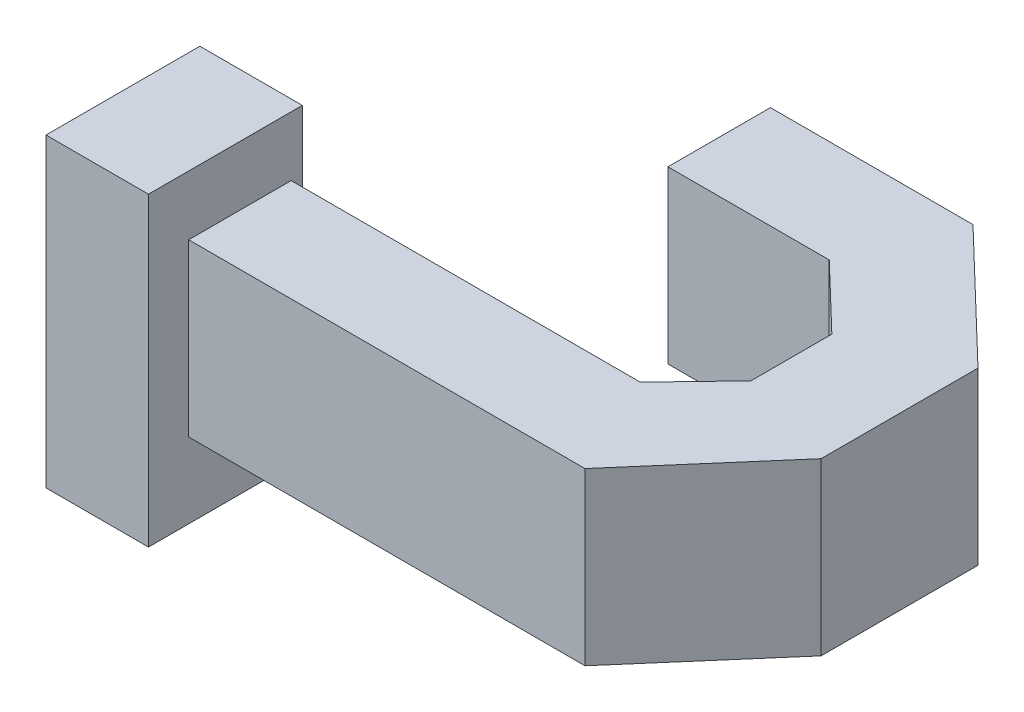
ISO-10303-21;
HEADER;
FILE_DESCRIPTION(('STEP AP214'),'2;1');
FILE_NAME('part.step','',(''),(''),'','','');
FILE_SCHEMA(('AUTOMOTIVE_DESIGN { 1 0 10303 214 1 1 1 1 }'));
ENDSEC;
DATA;
#1=APPLICATION_CONTEXT('core data for automotive mechanical design processes');
#2=APPLICATION_PROTOCOL_DEFINITION('international standard','automotive_design',2000,#1);
#3=PRODUCT_CONTEXT('',#1,'mechanical');
#4=PRODUCT('Part','Part','',(#3));
#5=PRODUCT_RELATED_PRODUCT_CATEGORY('part','',(#4));
#6=PRODUCT_DEFINITION_FORMATION('','',#4);
#7=PRODUCT_DEFINITION_CONTEXT('part definition',#1,'design');
#8=PRODUCT_DEFINITION('design','',#6,#7);
#9=PRODUCT_DEFINITION_SHAPE('','',#8);
#10=(LENGTH_UNIT() NAMED_UNIT(*) SI_UNIT(.MILLI.,.METRE.));
#11=(NAMED_UNIT(*) PLANE_ANGLE_UNIT() SI_UNIT($,.RADIAN.));
#12=(NAMED_UNIT(*) SI_UNIT($,.STERADIAN.) SOLID_ANGLE_UNIT());
#13=UNCERTAINTY_MEASURE_WITH_UNIT(LENGTH_MEASURE(1.E-05),#10,'distance_accuracy_value','');
#14=(GEOMETRIC_REPRESENTATION_CONTEXT(3) GLOBAL_UNCERTAINTY_ASSIGNED_CONTEXT((#13)) GLOBAL_UNIT_ASSIGNED_CONTEXT((#10,
#11,#12)) REPRESENTATION_CONTEXT('',''));
#15=CARTESIAN_POINT('',(0.,0.,0.));
#16=DIRECTION('',(0.,0.,1.));
#17=DIRECTION('',(1.,0.,0.));
#18=AXIS2_PLACEMENT_3D('',#15,#16,#17);
#19=CARTESIAN_POINT('',(0.,5.,0.));
#20=DIRECTION('',(0.,0.,-1.));
#21=DIRECTION('',(-1.,0.,0.));
#22=AXIS2_PLACEMENT_3D('',#19,#20,#21);
#23=PLANE('',#22);
#24=DIRECTION('',(1.,0.,0.));
#25=VECTOR('',#24,1.);
#26=CARTESIAN_POINT('',(0.,0.,0.));
#27=LINE('',#26,#25);
#28=CARTESIAN_POINT('',(0.,0.,0.));
#29=VERTEX_POINT('',#28);
#30=CARTESIAN_POINT('',(11.6005465733515,0.,0.));
#31=VERTEX_POINT('',#30);
#32=EDGE_CURVE('E164',#29,#31,#27,.T.);
#33=ORIENTED_EDGE('',*,*,#32,.T.);
#34=DIRECTION('',(0.,-1.,0.));
#35=VECTOR('',#34,1.);
#36=CARTESIAN_POINT('',(11.6005465733515,5.,0.));
#37=LINE('',#36,#35);
#38=CARTESIAN_POINT('',(11.6005465733515,5.,0.));
#39=VERTEX_POINT('',#38);
#40=EDGE_CURVE('E48',#39,#31,#37,.T.);
#41=ORIENTED_EDGE('',*,*,#40,.F.);
#42=DIRECTION('',(1.,0.,0.));
#43=VECTOR('',#42,1.);
#44=CARTESIAN_POINT('',(0.,5.,0.));
#45=LINE('',#44,#43);
#46=CARTESIAN_POINT('',(0.,5.,0.));
#47=VERTEX_POINT('',#46);
#48=EDGE_CURVE('E110',#47,#39,#45,.T.);
#49=ORIENTED_EDGE('',*,*,#48,.F.);
#50=DIRECTION('',(0.,-1.,0.));
#51=VECTOR('',#50,1.);
#52=CARTESIAN_POINT('',(0.,5.,0.));
#53=LINE('',#52,#51);
#54=EDGE_CURVE('E11',#47,#29,#53,.T.);
#55=ORIENTED_EDGE('',*,*,#54,.T.);
#56=EDGE_LOOP('',(#33,#41,#49,#55));
#57=FACE_BOUND('',#56,.T.);
#58=ADVANCED_FACE('F39',(#57),#23,.F.);
#59=CARTESIAN_POINT('',(11.6005465733515,5.,0.));
#60=DIRECTION('',(-0.756521561942777,0.,-0.653968750259262));
#61=DIRECTION('',(-0.653968750259262,0.,0.756521561942777));
#62=AXIS2_PLACEMENT_3D('',#59,#60,#61);
#63=PLANE('',#62);
#64=DIRECTION('',(0.653968750259262,0.,-0.756521561942777));
#65=VECTOR('',#64,1.);
#66=CARTESIAN_POINT('',(11.6005465733515,0.,0.));
#67=LINE('',#66,#65);
#68=CARTESIAN_POINT('',(14.8053720095012,0.,-3.70739357767274));
#69=VERTEX_POINT('',#68);
#70=EDGE_CURVE('E168',#31,#69,#67,.T.);
#71=ORIENTED_EDGE('',*,*,#70,.T.);
#72=DIRECTION('',(0.,-1.,0.));
#73=VECTOR('',#72,1.);
#74=CARTESIAN_POINT('',(14.8053720095012,5.,-3.70739357767274));
#75=LINE('',#74,#73);
#76=CARTESIAN_POINT('',(14.8053720095012,5.,-3.70739357767274));
#77=VERTEX_POINT('',#76);
#78=EDGE_CURVE('E225',#77,#69,#75,.T.);
#79=ORIENTED_EDGE('',*,*,#78,.F.);
#80=DIRECTION('',(0.653968750259262,0.,-0.756521561942777));
#81=VECTOR('',#80,1.);
#82=CARTESIAN_POINT('',(11.6005465733515,5.,0.));
#83=LINE('',#82,#81);
#84=EDGE_CURVE('E235',#39,#77,#83,.T.);
#85=ORIENTED_EDGE('',*,*,#84,.F.);
#86=ORIENTED_EDGE('',*,*,#40,.T.);
#87=EDGE_LOOP('',(#71,#79,#85,#86));
#88=FACE_BOUND('',#87,.T.);
#89=ADVANCED_FACE('F233',(#88),#63,.F.);
#90=CARTESIAN_POINT('',(14.8053720095012,5.,-3.70739357767274));
#91=DIRECTION('',(-1.,0.,0.));
#92=DIRECTION('',(0.,0.,1.));
#93=AXIS2_PLACEMENT_3D('',#90,#91,#92);
#94=PLANE('',#93);
#95=DIRECTION('',(0.,0.,-1.));
#96=VECTOR('',#95,1.);
#97=CARTESIAN_POINT('',(14.8053720095012,0.,-3.70739357767274));
#98=LINE('',#97,#96);
#99=CARTESIAN_POINT('',(14.8053720095012,0.,-8.2996727923636));
#100=VERTEX_POINT('',#99);
#101=EDGE_CURVE('E171',#69,#100,#98,.T.);
#102=ORIENTED_EDGE('',*,*,#101,.T.);
#103=DIRECTION('',(0.,-1.,0.));
#104=VECTOR('',#103,1.);
#105=CARTESIAN_POINT('',(14.8053720095012,5.,-8.2996727923636));
#106=LINE('',#105,#104);
#107=CARTESIAN_POINT('',(14.8053720095012,5.,-8.2996727923636));
#108=VERTEX_POINT('',#107);
#109=EDGE_CURVE('E221',#108,#100,#106,.T.);
#110=ORIENTED_EDGE('',*,*,#109,.F.);
#111=DIRECTION('',(0.,0.,-1.));
#112=VECTOR('',#111,1.);
#113=CARTESIAN_POINT('',(14.8053720095012,5.,-3.70739357767274));
#114=LINE('',#113,#112);
#115=EDGE_CURVE('E254',#77,#108,#114,.T.);
#116=ORIENTED_EDGE('',*,*,#115,.F.);
#117=ORIENTED_EDGE('',*,*,#78,.T.);
#118=EDGE_LOOP('',(#102,#110,#116,#117));
#119=FACE_BOUND('',#118,.T.);
#120=ADVANCED_FACE('F244',(#119),#94,.F.);
#121=CARTESIAN_POINT('',(14.8053720095012,5.,-8.2996727923636));
#122=DIRECTION('',(-0.692665788178113,0.,0.721258695536902));
#123=DIRECTION('',(0.721258695536902,0.,0.692665788178113));
#124=AXIS2_PLACEMENT_3D('',#121,#122,#123);
#125=PLANE('',#124);
#126=DIRECTION('',(-0.721258695536902,0.,-0.692665788178113));
#127=VECTOR('',#126,1.);
#128=CARTESIAN_POINT('',(14.8053720095012,0.,-8.2996727923636));
#129=LINE('',#128,#127);
#130=CARTESIAN_POINT('',(11.0936471199892,0.,-11.8642535204757));
#131=VERTEX_POINT('',#130);
#132=EDGE_CURVE('E174',#100,#131,#129,.T.);
#133=ORIENTED_EDGE('',*,*,#132,.T.);
#134=DIRECTION('',(0.,-1.,0.));
#135=VECTOR('',#134,1.);
#136=CARTESIAN_POINT('',(11.0936471199892,5.,-11.8642535204757));
#137=LINE('',#136,#135);
#138=CARTESIAN_POINT('',(11.0936471199892,5.,-11.8642535204757));
#139=VERTEX_POINT('',#138);
#140=EDGE_CURVE('E217',#139,#131,#137,.T.);
#141=ORIENTED_EDGE('',*,*,#140,.F.);
#142=DIRECTION('',(-0.721258695536902,0.,-0.692665788178113));
#143=VECTOR('',#142,1.);
#144=CARTESIAN_POINT('',(14.8053720095012,5.,-8.2996727923636));
#145=LINE('',#144,#143);
#146=EDGE_CURVE('E250',#108,#139,#145,.T.);
#147=ORIENTED_EDGE('',*,*,#146,.F.);
#148=ORIENTED_EDGE('',*,*,#109,.T.);
#149=EDGE_LOOP('',(#133,#141,#147,#148));
#150=FACE_BOUND('',#149,.T.);
#151=ADVANCED_FACE('F248',(#150),#125,.F.);
#152=CARTESIAN_POINT('',(11.0936471199892,5.,-11.8642535204757));
#153=DIRECTION('',(0.,0.,1.));
#154=DIRECTION('',(1.,0.,0.));
#155=AXIS2_PLACEMENT_3D('',#152,#153,#154);
#156=PLANE('',#155);
#157=DIRECTION('',(-1.,0.,0.));
#158=VECTOR('',#157,1.);
#159=CARTESIAN_POINT('',(11.0936471199892,0.,-11.8642535204757));
#160=LINE('',#159,#158);
#161=CARTESIAN_POINT('',(5.16455696202534,0.,-11.8642535204757));
#162=VERTEX_POINT('',#161);
#163=EDGE_CURVE('E177',#131,#162,#160,.T.);
#164=ORIENTED_EDGE('',*,*,#163,.T.);
#165=DIRECTION('',(0.,-1.,0.));
#166=VECTOR('',#165,1.);
#167=CARTESIAN_POINT('',(5.16455696202534,5.,-11.8642535204757));
#168=LINE('',#167,#166);
#169=CARTESIAN_POINT('',(5.16455696202534,5.,-11.8642535204757));
#170=VERTEX_POINT('',#169);
#171=EDGE_CURVE('E213',#170,#162,#168,.T.);
#172=ORIENTED_EDGE('',*,*,#171,.F.);
#173=DIRECTION('',(-1.,0.,0.));
#174=VECTOR('',#173,1.);
#175=CARTESIAN_POINT('',(11.0936471199892,5.,-11.8642535204757));
#176=LINE('',#175,#174);
#177=EDGE_CURVE('E253',#139,#170,#176,.T.);
#178=ORIENTED_EDGE('',*,*,#177,.F.);
#179=ORIENTED_EDGE('',*,*,#140,.T.);
#180=EDGE_LOOP('',(#164,#172,#178,#179));
#181=FACE_BOUND('',#180,.T.);
#182=ADVANCED_FACE('F391',(#181),#156,.F.);
#183=CARTESIAN_POINT('',(5.16455696202534,5.,-11.8642535204757));
#184=DIRECTION('',(1.,0.,0.));
#185=DIRECTION('',(0.,0.,-1.));
#186=AXIS2_PLACEMENT_3D('',#183,#184,#185);
#187=PLANE('',#186);
#188=DIRECTION('',(0.,0.,1.));
#189=VECTOR('',#188,1.);
#190=CARTESIAN_POINT('',(5.16455696202534,0.,-11.8642535204757));
#191=LINE('',#190,#189);
#192=CARTESIAN_POINT('',(5.16455696202534,0.,-8.8642535204757));
#193=VERTEX_POINT('',#192);
#194=EDGE_CURVE('E180',#162,#193,#191,.T.);
#195=ORIENTED_EDGE('',*,*,#194,.T.);
#196=DIRECTION('',(0.,-1.,0.));
#197=VECTOR('',#196,1.);
#198=CARTESIAN_POINT('',(5.16455696202534,5.,-8.8642535204757));
#199=LINE('',#198,#197);
#200=CARTESIAN_POINT('',(5.16455696202534,5.,-8.8642535204757));
#201=VERTEX_POINT('',#200);
#202=EDGE_CURVE('E209',#201,#193,#199,.T.);
#203=ORIENTED_EDGE('',*,*,#202,.F.);
#204=DIRECTION('',(0.,0.,1.));
#205=VECTOR('',#204,1.);
#206=CARTESIAN_POINT('',(5.16455696202534,5.,-11.8642535204757));
#207=LINE('',#206,#205);
#208=EDGE_CURVE('E258',#170,#201,#207,.T.);
#209=ORIENTED_EDGE('',*,*,#208,.F.);
#210=ORIENTED_EDGE('',*,*,#171,.T.);
#211=EDGE_LOOP('',(#195,#203,#209,#210));
#212=FACE_BOUND('',#211,.T.);
#213=ADVANCED_FACE('F394',(#212),#187,.F.);
#214=CARTESIAN_POINT('',(5.16455696202534,5.,-8.8642535204757));
#215=DIRECTION('',(0.,0.,-1.));
#216=DIRECTION('',(-1.,0.,0.));
#217=AXIS2_PLACEMENT_3D('',#214,#215,#216);
#218=PLANE('',#217);
#219=DIRECTION('',(1.,0.,0.));
#220=VECTOR('',#219,1.);
#221=CARTESIAN_POINT('',(5.16455696202534,0.,-8.8642535204757));
#222=LINE('',#221,#220);
#223=CARTESIAN_POINT('',(9.88639258589597,0.,-8.8642535204757));
#224=VERTEX_POINT('',#223);
#225=EDGE_CURVE('E183',#193,#224,#222,.T.);
#226=ORIENTED_EDGE('',*,*,#225,.T.);
#227=DIRECTION('',(0.,-1.,0.));
#228=VECTOR('',#227,1.);
#229=CARTESIAN_POINT('',(9.88639258589597,5.,-8.8642535204757));
#230=LINE('',#229,#228);
#231=CARTESIAN_POINT('',(9.88639258589597,5.,-8.8642535204757));
#232=VERTEX_POINT('',#231);
#233=EDGE_CURVE('E205',#232,#224,#230,.T.);
#234=ORIENTED_EDGE('',*,*,#233,.F.);
#235=DIRECTION('',(1.,0.,0.));
#236=VECTOR('',#235,1.);
#237=CARTESIAN_POINT('',(5.16455696202534,5.,-8.8642535204757));
#238=LINE('',#237,#236);
#239=EDGE_CURVE('E265',#201,#232,#238,.T.);
#240=ORIENTED_EDGE('',*,*,#239,.F.);
#241=ORIENTED_EDGE('',*,*,#202,.T.);
#242=EDGE_LOOP('',(#226,#234,#240,#241));
#243=FACE_BOUND('',#242,.T.);
#244=ADVANCED_FACE('F273',(#243),#218,.F.);
#245=CARTESIAN_POINT('',(9.88639258589597,5.,-8.8642535204757));
#246=DIRECTION('',(0.692665788178113,0.,-0.721258695536902));
#247=DIRECTION('',(-0.721258695536902,0.,-0.692665788178113));
#248=AXIS2_PLACEMENT_3D('',#245,#246,#247);
#249=PLANE('',#248);
#250=DIRECTION('',(0.721258695536902,0.,0.692665788178113));
#251=VECTOR('',#250,1.);
#252=CARTESIAN_POINT('',(9.88639258589597,0.,-8.8642535204757));
#253=LINE('',#252,#251);
#254=CARTESIAN_POINT('',(11.8053720095012,0.,-7.02134832824143));
#255=VERTEX_POINT('',#254);
#256=EDGE_CURVE('E186',#224,#255,#253,.T.);
#257=ORIENTED_EDGE('',*,*,#256,.T.);
#258=DIRECTION('',(0.,-1.,0.));
#259=VECTOR('',#258,1.);
#260=CARTESIAN_POINT('',(11.8053720095012,5.,-7.02134832824143));
#261=LINE('',#260,#259);
#262=CARTESIAN_POINT('',(11.8053720095012,5.,-7.02134832824143));
#263=VERTEX_POINT('',#262);
#264=EDGE_CURVE('E149',#263,#255,#261,.T.);
#265=ORIENTED_EDGE('',*,*,#264,.F.);
#266=DIRECTION('',(0.721258695536902,0.,0.692665788178113));
#267=VECTOR('',#266,1.);
#268=CARTESIAN_POINT('',(9.88639258589597,5.,-8.8642535204757));
#269=LINE('',#268,#267);
#270=EDGE_CURVE('E142',#232,#263,#269,.T.);
#271=ORIENTED_EDGE('',*,*,#270,.F.);
#272=ORIENTED_EDGE('',*,*,#233,.T.);
#273=EDGE_LOOP('',(#257,#265,#271,#272));
#274=FACE_BOUND('',#273,.T.);
#275=ADVANCED_FACE('F277',(#274),#249,.F.);
#276=CARTESIAN_POINT('',(11.8053720095012,5.,-7.02134832824143));
#277=DIRECTION('',(1.,0.,0.));
#278=DIRECTION('',(0.,0.,-1.));
#279=AXIS2_PLACEMENT_3D('',#276,#277,#278);
#280=PLANE('',#279);
#281=DIRECTION('',(0.,0.,1.));
#282=VECTOR('',#281,1.);
#283=CARTESIAN_POINT('',(11.8053720095012,0.,-7.02134832824143));
#284=LINE('',#283,#282);
#285=CARTESIAN_POINT('',(11.8053720095012,0.,-4.6522729308791));
#286=VERTEX_POINT('',#285);
#287=EDGE_CURVE('E95',#255,#286,#284,.T.);
#288=ORIENTED_EDGE('',*,*,#287,.T.);
#289=DIRECTION('',(0.,-1.,0.));
#290=VECTOR('',#289,1.);
#291=CARTESIAN_POINT('',(11.8053720095012,5.,-4.6522729308791));
#292=LINE('',#291,#290);
#293=CARTESIAN_POINT('',(11.8053720095012,5.,-4.6522729308791));
#294=VERTEX_POINT('',#293);
#295=EDGE_CURVE('E146',#294,#286,#292,.T.);
#296=ORIENTED_EDGE('',*,*,#295,.F.);
#297=DIRECTION('',(0.,0.,1.));
#298=VECTOR('',#297,1.);
#299=CARTESIAN_POINT('',(11.8053720095012,5.,-7.02134832824143));
#300=LINE('',#299,#298);
#301=EDGE_CURVE('E137',#263,#294,#300,.T.);
#302=ORIENTED_EDGE('',*,*,#301,.F.);
#303=ORIENTED_EDGE('',*,*,#264,.T.);
#304=EDGE_LOOP('',(#288,#296,#302,#303));
#305=FACE_BOUND('',#304,.T.);
#306=ADVANCED_FACE('F147',(#305),#280,.F.);
#307=CARTESIAN_POINT('',(11.8053720095012,5.,-4.6522729308791));
#308=DIRECTION('',(0.721258695536902,0.,0.692665788178113));
#309=DIRECTION('',(0.692665788178113,0.,-0.721258695536902));
#310=AXIS2_PLACEMENT_3D('',#307,#308,#309);
#311=PLANE('',#310);
#312=DIRECTION('',(-0.692665788178113,0.,0.721258695536902));
#313=VECTOR('',#312,1.);
#314=CARTESIAN_POINT('',(11.8053720095012,0.,-4.6522729308791));
#315=LINE('',#314,#313);
#316=CARTESIAN_POINT('',(10.2186002464228,0.,-3.));
#317=VERTEX_POINT('',#316);
#318=EDGE_CURVE('E102',#286,#317,#315,.T.);
#319=ORIENTED_EDGE('',*,*,#318,.T.);
#320=DIRECTION('',(0.,-1.,0.));
#321=VECTOR('',#320,1.);
#322=CARTESIAN_POINT('',(10.2186002464228,5.,-3.));
#323=LINE('',#322,#321);
#324=CARTESIAN_POINT('',(10.2186002464228,5.,-3.));
#325=VERTEX_POINT('',#324);
#326=EDGE_CURVE('E150',#325,#317,#323,.T.);
#327=ORIENTED_EDGE('',*,*,#326,.F.);
#328=DIRECTION('',(-0.692665788178113,0.,0.721258695536902));
#329=VECTOR('',#328,1.);
#330=CARTESIAN_POINT('',(11.8053720095012,5.,-4.6522729308791));
#331=LINE('',#330,#329);
#332=EDGE_CURVE('E140',#294,#325,#331,.T.);
#333=ORIENTED_EDGE('',*,*,#332,.F.);
#334=ORIENTED_EDGE('',*,*,#295,.T.);
#335=EDGE_LOOP('',(#319,#327,#333,#334));
#336=FACE_BOUND('',#335,.T.);
#337=ADVANCED_FACE('F152',(#336),#311,.F.);
#338=CARTESIAN_POINT('',(10.2186002464228,5.,-3.));
#339=DIRECTION('',(0.,0.,1.));
#340=DIRECTION('',(1.,0.,0.));
#341=AXIS2_PLACEMENT_3D('',#338,#339,#340);
#342=PLANE('',#341);
#343=DIRECTION('',(-1.,0.,0.));
#344=VECTOR('',#343,1.);
#345=CARTESIAN_POINT('',(10.2186002464228,0.,-3.));
#346=LINE('',#345,#344);
#347=CARTESIAN_POINT('',(0.,0.,-3.));
#348=VERTEX_POINT('',#347);
#349=EDGE_CURVE('E193',#317,#348,#346,.T.);
#350=ORIENTED_EDGE('',*,*,#349,.T.);
#351=DIRECTION('',(0.,-1.,0.));
#352=VECTOR('',#351,1.);
#353=CARTESIAN_POINT('',(0.,5.,-3.));
#354=LINE('',#353,#352);
#355=CARTESIAN_POINT('',(0.,5.,-3.));
#356=VERTEX_POINT('',#355);
#357=EDGE_CURVE('E156',#356,#348,#354,.T.);
#358=ORIENTED_EDGE('',*,*,#357,.F.);
#359=DIRECTION('',(-1.,0.,0.));
#360=VECTOR('',#359,1.);
#361=CARTESIAN_POINT('',(10.2186002464228,5.,-3.));
#362=LINE('',#361,#360);
#363=EDGE_CURVE('E56',#325,#356,#362,.T.);
#364=ORIENTED_EDGE('',*,*,#363,.F.);
#365=ORIENTED_EDGE('',*,*,#326,.T.);
#366=EDGE_LOOP('',(#350,#358,#364,#365));
#367=FACE_BOUND('',#366,.T.);
#368=ADVANCED_FACE('F280',(#367),#342,.F.);
#369=CARTESIAN_POINT('',(0.,5.,0.));
#370=DIRECTION('',(0.,1.,0.));
#371=DIRECTION('',(0.,0.,1.));
#372=AXIS2_PLACEMENT_3D('',#369,#370,#371);
#373=PLANE('',#372);
#374=DIRECTION('',(0.,0.,1.));
#375=VECTOR('',#374,1.);
#376=CARTESIAN_POINT('',(0.,5.,-3.));
#377=LINE('',#376,#375);
#378=EDGE_CURVE('E197',#356,#47,#377,.T.);
#379=ORIENTED_EDGE('',*,*,#378,.T.);
#380=ORIENTED_EDGE('',*,*,#48,.T.);
#381=ORIENTED_EDGE('',*,*,#84,.T.);
#382=ORIENTED_EDGE('',*,*,#115,.T.);
#383=ORIENTED_EDGE('',*,*,#146,.T.);
#384=ORIENTED_EDGE('',*,*,#177,.T.);
#385=ORIENTED_EDGE('',*,*,#208,.T.);
#386=ORIENTED_EDGE('',*,*,#239,.T.);
#387=ORIENTED_EDGE('',*,*,#270,.T.);
#388=ORIENTED_EDGE('',*,*,#301,.T.);
#389=ORIENTED_EDGE('',*,*,#332,.T.);
#390=ORIENTED_EDGE('',*,*,#363,.T.);
#391=EDGE_LOOP('',(#379,#380,#381,#382,#383,#384,#385,#386,#387,#388,#389,#390));
#392=FACE_BOUND('',#391,.T.);
#393=ADVANCED_FACE('F138',(#392),#373,.T.);
#394=CARTESIAN_POINT('',(0.,0.,0.));
#395=DIRECTION('',(0.,1.,0.));
#396=DIRECTION('',(0.,0.,1.));
#397=AXIS2_PLACEMENT_3D('',#394,#395,#396);
#398=PLANE('',#397);
#399=DIRECTION('',(0.,0.,1.));
#400=VECTOR('',#399,1.);
#401=CARTESIAN_POINT('',(0.,0.,-3.));
#402=LINE('',#401,#400);
#403=EDGE_CURVE('E160',#348,#29,#402,.T.);
#404=ORIENTED_EDGE('',*,*,#403,.F.);
#405=ORIENTED_EDGE('',*,*,#349,.F.);
#406=ORIENTED_EDGE('',*,*,#318,.F.);
#407=ORIENTED_EDGE('',*,*,#287,.F.);
#408=ORIENTED_EDGE('',*,*,#256,.F.);
#409=ORIENTED_EDGE('',*,*,#225,.F.);
#410=ORIENTED_EDGE('',*,*,#194,.F.);
#411=ORIENTED_EDGE('',*,*,#163,.F.);
#412=ORIENTED_EDGE('',*,*,#132,.F.);
#413=ORIENTED_EDGE('',*,*,#101,.F.);
#414=ORIENTED_EDGE('',*,*,#70,.F.);
#415=ORIENTED_EDGE('',*,*,#32,.F.);
#416=EDGE_LOOP('',(#404,#405,#406,#407,#408,#409,#410,#411,#412,#413,#414,#415));
#417=FACE_BOUND('',#416,.T.);
#418=ADVANCED_FACE('F239',(#417),#398,.F.);
#419=CARTESIAN_POINT('',(0.,0.,0.));
#420=DIRECTION('',(-1.,0.,0.));
#421=DIRECTION('',(0.,0.,1.));
#422=AXIS2_PLACEMENT_3D('',#419,#420,#421);
#423=PLANE('',#422);
#424=DIRECTION('',(0.,-1.,0.));
#425=VECTOR('',#424,1.);
#426=CARTESIAN_POINT('',(0.,6.74370001676246,-3.3263091448035));
#427=LINE('',#426,#425);
#428=CARTESIAN_POINT('',(0.,6.74370001676246,-3.3263091448035));
#429=VERTEX_POINT('',#428);
#430=CARTESIAN_POINT('',(0.,-2.20254018369188,-3.3263091448035));
#431=VERTEX_POINT('',#430);
#432=EDGE_CURVE('E321',#429,#431,#427,.T.);
#433=ORIENTED_EDGE('',*,*,#432,.F.);
#434=DIRECTION('',(0.,0.,-1.));
#435=VECTOR('',#434,1.);
#436=CARTESIAN_POINT('',(0.,6.74370001676246,-3.3263091448035));
#437=LINE('',#436,#435);
#438=CARTESIAN_POINT('',(0.,6.74370001676246,1.17683189569365));
#439=VERTEX_POINT('',#438);
#440=EDGE_CURVE('E308',#439,#429,#437,.T.);
#441=ORIENTED_EDGE('',*,*,#440,.F.);
#442=DIRECTION('',(0.,1.,0.));
#443=VECTOR('',#442,1.);
#444=CARTESIAN_POINT('',(0.,6.74370001676246,1.17683189569365));
#445=LINE('',#444,#443);
#446=CARTESIAN_POINT('',(0.,-2.20254018369188,1.17683189569365));
#447=VERTEX_POINT('',#446);
#448=EDGE_CURVE('E313',#447,#439,#445,.T.);
#449=ORIENTED_EDGE('',*,*,#448,.F.);
#450=DIRECTION('',(0.,0.,1.));
#451=VECTOR('',#450,1.);
#452=CARTESIAN_POINT('',(0.,-2.20254018369188,-3.3263091448035));
#453=LINE('',#452,#451);
#454=EDGE_CURVE('E317',#431,#447,#453,.T.);
#455=ORIENTED_EDGE('',*,*,#454,.F.);
#456=EDGE_LOOP('',(#433,#441,#449,#455));
#457=FACE_BOUND('',#456,.T.);
#458=ORIENTED_EDGE('',*,*,#357,.T.);
#459=ORIENTED_EDGE('',*,*,#403,.T.);
#460=ORIENTED_EDGE('',*,*,#54,.F.);
#461=ORIENTED_EDGE('',*,*,#378,.F.);
#462=EDGE_LOOP('',(#458,#459,#460,#461));
#463=FACE_BOUND('',#462,.T.);
#464=ADVANCED_FACE('F284',(#457,#463),#423,.F.);
#465=CARTESIAN_POINT('',(-3.,6.74370001676246,-3.3263091448035));
#466=DIRECTION('',(0.,0.,1.));
#467=DIRECTION('',(1.,0.,0.));
#468=AXIS2_PLACEMENT_3D('',#465,#466,#467);
#469=PLANE('',#468);
#470=ORIENTED_EDGE('',*,*,#432,.T.);
#471=DIRECTION('',(1.,0.,0.));
#472=VECTOR('',#471,1.);
#473=CARTESIAN_POINT('',(-3.,-2.20254018369188,-3.3263091448035));
#474=LINE('',#473,#472);
#475=CARTESIAN_POINT('',(-3.,-2.20254018369188,-3.3263091448035));
#476=VERTEX_POINT('',#475);
#477=EDGE_CURVE('E165',#476,#431,#474,.T.);
#478=ORIENTED_EDGE('',*,*,#477,.F.);
#479=DIRECTION('',(0.,-1.,0.));
#480=VECTOR('',#479,1.);
#481=CARTESIAN_POINT('',(-3.,6.74370001676246,-3.3263091448035));
#482=LINE('',#481,#480);
#483=CARTESIAN_POINT('',(-3.,6.74370001676246,-3.3263091448035));
#484=VERTEX_POINT('',#483);
#485=EDGE_CURVE('E312',#484,#476,#482,.T.);
#486=ORIENTED_EDGE('',*,*,#485,.F.);
#487=DIRECTION('',(1.,0.,0.));
#488=VECTOR('',#487,1.);
#489=CARTESIAN_POINT('',(-3.,6.74370001676246,-3.3263091448035));
#490=LINE('',#489,#488);
#491=EDGE_CURVE('E303',#484,#429,#490,.T.);
#492=ORIENTED_EDGE('',*,*,#491,.T.);
#493=EDGE_LOOP('',(#470,#478,#486,#492));
#494=FACE_BOUND('',#493,.T.);
#495=ADVANCED_FACE('F351',(#494),#469,.F.);
#496=CARTESIAN_POINT('',(-3.,-2.20254018369188,-3.3263091448035));
#497=DIRECTION('',(0.,1.,0.));
#498=DIRECTION('',(0.,0.,1.));
#499=AXIS2_PLACEMENT_3D('',#496,#497,#498);
#500=PLANE('',#499);
#501=ORIENTED_EDGE('',*,*,#454,.T.);
#502=DIRECTION('',(1.,0.,0.));
#503=VECTOR('',#502,1.);
#504=CARTESIAN_POINT('',(-3.,-2.20254018369188,1.17683189569365));
#505=LINE('',#504,#503);
#506=CARTESIAN_POINT('',(-3.,-2.20254018369188,1.17683189569365));
#507=VERTEX_POINT('',#506);
#508=EDGE_CURVE('E295',#507,#447,#505,.T.);
#509=ORIENTED_EDGE('',*,*,#508,.F.);
#510=DIRECTION('',(0.,0.,1.));
#511=VECTOR('',#510,1.);
#512=CARTESIAN_POINT('',(-3.,-2.20254018369188,-3.3263091448035));
#513=LINE('',#512,#511);
#514=EDGE_CURVE('E332',#476,#507,#513,.T.);
#515=ORIENTED_EDGE('',*,*,#514,.F.);
#516=ORIENTED_EDGE('',*,*,#477,.T.);
#517=EDGE_LOOP('',(#501,#509,#515,#516));
#518=FACE_BOUND('',#517,.T.);
#519=ADVANCED_FACE('F355',(#518),#500,.F.);
#520=CARTESIAN_POINT('',(-3.,6.74370001676246,1.17683189569365));
#521=DIRECTION('',(0.,0.,-1.));
#522=DIRECTION('',(-1.,0.,0.));
#523=AXIS2_PLACEMENT_3D('',#520,#521,#522);
#524=PLANE('',#523);
#525=ORIENTED_EDGE('',*,*,#448,.T.);
#526=DIRECTION('',(1.,0.,0.));
#527=VECTOR('',#526,1.);
#528=CARTESIAN_POINT('',(-3.,6.74370001676246,1.17683189569365));
#529=LINE('',#528,#527);
#530=CARTESIAN_POINT('',(-3.,6.74370001676246,1.17683189569365));
#531=VERTEX_POINT('',#530);
#532=EDGE_CURVE('E299',#531,#439,#529,.T.);
#533=ORIENTED_EDGE('',*,*,#532,.F.);
#534=DIRECTION('',(0.,1.,0.));
#535=VECTOR('',#534,1.);
#536=CARTESIAN_POINT('',(-3.,6.74370001676246,1.17683189569365));
#537=LINE('',#536,#535);
#538=EDGE_CURVE('E328',#507,#531,#537,.T.);
#539=ORIENTED_EDGE('',*,*,#538,.F.);
#540=ORIENTED_EDGE('',*,*,#508,.T.);
#541=EDGE_LOOP('',(#525,#533,#539,#540));
#542=FACE_BOUND('',#541,.T.);
#543=ADVANCED_FACE('F413',(#542),#524,.F.);
#544=CARTESIAN_POINT('',(-3.,6.74370001676246,-3.3263091448035));
#545=DIRECTION('',(0.,-1.,0.));
#546=DIRECTION('',(0.,0.,-1.));
#547=AXIS2_PLACEMENT_3D('',#544,#545,#546);
#548=PLANE('',#547);
#549=ORIENTED_EDGE('',*,*,#440,.T.);
#550=ORIENTED_EDGE('',*,*,#491,.F.);
#551=DIRECTION('',(0.,0.,-1.));
#552=VECTOR('',#551,1.);
#553=CARTESIAN_POINT('',(-3.,6.74370001676246,-3.3263091448035));
#554=LINE('',#553,#552);
#555=EDGE_CURVE('E307',#531,#484,#554,.T.);
#556=ORIENTED_EDGE('',*,*,#555,.F.);
#557=ORIENTED_EDGE('',*,*,#532,.T.);
#558=EDGE_LOOP('',(#549,#550,#556,#557));
#559=FACE_BOUND('',#558,.T.);
#560=ADVANCED_FACE('F368',(#559),#548,.F.);
#561=CARTESIAN_POINT('',(-3.,0.,0.));
#562=DIRECTION('',(-1.,0.,0.));
#563=DIRECTION('',(0.,0.,1.));
#564=AXIS2_PLACEMENT_3D('',#561,#562,#563);
#565=PLANE('',#564);
#566=ORIENTED_EDGE('',*,*,#485,.T.);
#567=ORIENTED_EDGE('',*,*,#514,.T.);
#568=ORIENTED_EDGE('',*,*,#538,.T.);
#569=ORIENTED_EDGE('',*,*,#555,.T.);
#570=EDGE_LOOP('',(#566,#567,#568,#569));
#571=FACE_BOUND('',#570,.T.);
#572=ADVANCED_FACE('F342',(#571),#565,.T.);
#573=CLOSED_SHELL('',(#58,#89,#120,#151,#182,#213,#244,#275,#306,#337,#368,#393,#418,#464,#495,
#519,#543,#560,#572));
#574=MANIFOLD_SOLID_BREP('B2',#573);
#575=ADVANCED_BREP_SHAPE_REPRESENTATION('',(#18,#574),#14);
#576=SHAPE_DEFINITION_REPRESENTATION(#9,#575);
ENDSEC;
END-ISO-10303-21;
